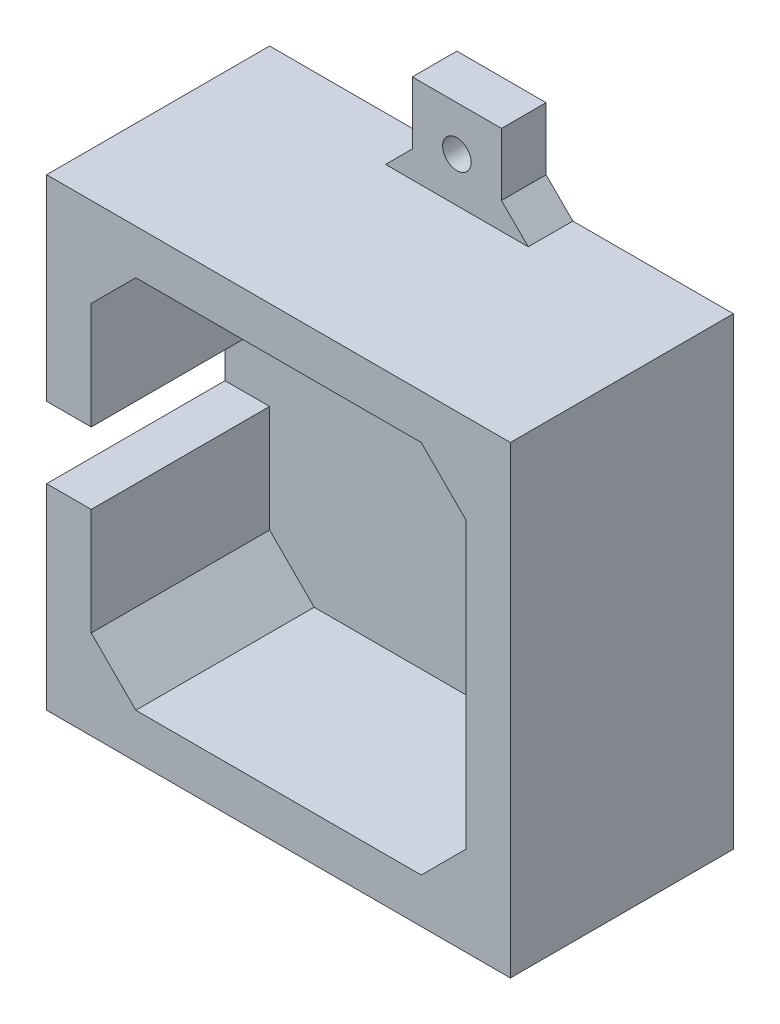
ISO-10303-21;
HEADER;
FILE_DESCRIPTION(('STEP AP214'),'2;1');
FILE_NAME('part.step','',(''),(''),'','','');
FILE_SCHEMA(('AUTOMOTIVE_DESIGN { 1 0 10303 214 1 1 1 1 }'));
ENDSEC;
DATA;
#1=APPLICATION_CONTEXT('core data for automotive mechanical design processes');
#2=APPLICATION_PROTOCOL_DEFINITION('international standard','automotive_design',2000,#1);
#3=PRODUCT_CONTEXT('',#1,'mechanical');
#4=PRODUCT('Part','Part','',(#3));
#5=PRODUCT_RELATED_PRODUCT_CATEGORY('part','',(#4));
#6=PRODUCT_DEFINITION_FORMATION('','',#4);
#7=PRODUCT_DEFINITION_CONTEXT('part definition',#1,'design');
#8=PRODUCT_DEFINITION('design','',#6,#7);
#9=PRODUCT_DEFINITION_SHAPE('','',#8);
#10=(LENGTH_UNIT() NAMED_UNIT(*) SI_UNIT(.MILLI.,.METRE.));
#11=(NAMED_UNIT(*) PLANE_ANGLE_UNIT() SI_UNIT($,.RADIAN.));
#12=(NAMED_UNIT(*) SI_UNIT($,.STERADIAN.) SOLID_ANGLE_UNIT());
#13=UNCERTAINTY_MEASURE_WITH_UNIT(LENGTH_MEASURE(1.E-05),#10,'distance_accuracy_value','');
#14=(GEOMETRIC_REPRESENTATION_CONTEXT(3) GLOBAL_UNCERTAINTY_ASSIGNED_CONTEXT((#13)) GLOBAL_UNIT_ASSIGNED_CONTEXT((#10,
#11,#12)) REPRESENTATION_CONTEXT('',''));
#15=CARTESIAN_POINT('',(0.,0.,0.));
#16=DIRECTION('',(0.,0.,1.));
#17=DIRECTION('',(1.,0.,0.));
#18=AXIS2_PLACEMENT_3D('',#15,#16,#17);
#19=CARTESIAN_POINT('',(0.,6.17050908734632,20.));
#20=DIRECTION('',(1.,0.,0.));
#21=DIRECTION('',(0.,1.,0.));
#22=AXIS2_PLACEMENT_3D('',#19,#20,#21);
#23=PLANE('',#22);
#24=DIRECTION('',(0.,-1.,0.));
#25=VECTOR('',#24,1.);
#26=CARTESIAN_POINT('',(0.,6.17050908734632,20.));
#27=LINE('',#26,#25);
#28=CARTESIAN_POINT('',(0.,38.1705090873463,20.));
#29=VERTEX_POINT('',#28);
#30=CARTESIAN_POINT('',(0.,26.1705090873463,20.));
#31=VERTEX_POINT('',#30);
#32=EDGE_CURVE('E350',#29,#31,#27,.T.);
#33=ORIENTED_EDGE('',*,*,#32,.T.);
#34=DIRECTION('',(0.,0.,-1.));
#35=VECTOR('',#34,1.);
#36=CARTESIAN_POINT('',(0.,26.1705090873463,20.));
#37=LINE('',#36,#35);
#38=CARTESIAN_POINT('',(0.,26.1705090873463,0.));
#39=VERTEX_POINT('',#38);
#40=EDGE_CURVE('E421',#31,#39,#37,.T.);
#41=ORIENTED_EDGE('',*,*,#40,.T.);
#42=DIRECTION('',(0.,-1.,0.));
#43=VECTOR('',#42,1.);
#44=CARTESIAN_POINT('',(0.,6.17050908734632,0.));
#45=LINE('',#44,#43);
#46=CARTESIAN_POINT('',(0.,38.1705090873463,0.));
#47=VERTEX_POINT('',#46);
#48=EDGE_CURVE('E372',#47,#39,#45,.T.);
#49=ORIENTED_EDGE('',*,*,#48,.F.);
#50=DIRECTION('',(0.,0.,-1.));
#51=VECTOR('',#50,1.);
#52=CARTESIAN_POINT('',(0.,38.1705090873463,20.));
#53=LINE('',#52,#51);
#54=EDGE_CURVE('E396',#29,#47,#53,.T.);
#55=ORIENTED_EDGE('',*,*,#54,.F.);
#56=EDGE_LOOP('',(#33,#41,#49,#55));
#57=FACE_BOUND('',#56,.T.);
#58=ADVANCED_FACE('F33',(#57),#23,.T.);
#59=CARTESIAN_POINT('',(-5.,48.1705090873463,20.));
#60=DIRECTION('',(0.,-1.,0.));
#61=DIRECTION('',(1.,0.,0.));
#62=AXIS2_PLACEMENT_3D('',#59,#60,#61);
#63=PLANE('',#62);
#64=DIRECTION('',(1.,0.,0.));
#65=VECTOR('',#64,1.);
#66=CARTESIAN_POINT('',(-5.00000000000001,48.1705090873463,-5.));
#67=LINE('',#66,#65);
#68=CARTESIAN_POINT('',(28.9999999999999,48.1705090873463,-5.));
#69=VERTEX_POINT('',#68);
#70=CARTESIAN_POINT('',(47.,48.1705090873463,-5.));
#71=VERTEX_POINT('',#70);
#72=EDGE_CURVE('E324',#69,#71,#67,.T.);
#73=ORIENTED_EDGE('',*,*,#72,.F.);
#74=DIRECTION('',(0.,0.,1.));
#75=VECTOR('',#74,1.);
#76=CARTESIAN_POINT('',(28.9999999999999,48.1705090873463,20.));
#77=LINE('',#76,#75);
#78=CARTESIAN_POINT('',(29.,48.1705090873463,0.));
#79=VERTEX_POINT('',#78);
#80=EDGE_CURVE('E284',#69,#79,#77,.T.);
#81=ORIENTED_EDGE('',*,*,#80,.T.);
#82=DIRECTION('',(-1.,0.,0.));
#83=VECTOR('',#82,1.);
#84=CARTESIAN_POINT('',(16.,48.1705090873463,0.));
#85=LINE('',#84,#83);
#86=CARTESIAN_POINT('',(13.,48.1705090873463,0.));
#87=VERTEX_POINT('',#86);
#88=EDGE_CURVE('E307',#79,#87,#85,.T.);
#89=ORIENTED_EDGE('',*,*,#88,.T.);
#90=DIRECTION('',(0.,0.,-1.));
#91=VECTOR('',#90,1.);
#92=CARTESIAN_POINT('',(13.,48.1705090873463,20.));
#93=LINE('',#92,#91);
#94=CARTESIAN_POINT('',(12.9999999999999,48.1705090873463,-5.));
#95=VERTEX_POINT('',#94);
#96=EDGE_CURVE('E281',#87,#95,#93,.T.);
#97=ORIENTED_EDGE('',*,*,#96,.T.);
#98=CARTESIAN_POINT('',(-5.00000000000001,48.1705090873463,-5.));
#99=VERTEX_POINT('',#98);
#100=EDGE_CURVE('E332',#99,#95,#67,.T.);
#101=ORIENTED_EDGE('',*,*,#100,.F.);
#102=DIRECTION('',(0.,0.,-1.));
#103=VECTOR('',#102,1.);
#104=CARTESIAN_POINT('',(-5.,48.1705090873463,20.));
#105=LINE('',#104,#103);
#106=CARTESIAN_POINT('',(-5.,48.1705090873463,20.));
#107=VERTEX_POINT('',#106);
#108=EDGE_CURVE('E258',#107,#99,#105,.T.);
#109=ORIENTED_EDGE('',*,*,#108,.F.);
#110=DIRECTION('',(-1.,0.,0.));
#111=VECTOR('',#110,1.);
#112=CARTESIAN_POINT('',(-5.,48.1705090873463,20.));
#113=LINE('',#112,#111);
#114=CARTESIAN_POINT('',(47.,48.1705090873463,20.));
#115=VERTEX_POINT('',#114);
#116=EDGE_CURVE('E256',#115,#107,#113,.T.);
#117=ORIENTED_EDGE('',*,*,#116,.F.);
#118=DIRECTION('',(0.,0.,-1.));
#119=VECTOR('',#118,1.);
#120=CARTESIAN_POINT('',(47.,48.1705090873463,20.));
#121=LINE('',#120,#119);
#122=EDGE_CURVE('E260',#115,#71,#121,.T.);
#123=ORIENTED_EDGE('',*,*,#122,.T.);
#124=EDGE_LOOP('',(#73,#81,#89,#97,#101,#109,#117,#123));
#125=FACE_BOUND('',#124,.T.);
#126=ADVANCED_FACE('F328',(#125),#63,.F.);
#127=CARTESIAN_POINT('',(47.,-3.82949091265368,20.));
#128=DIRECTION('',(0.,1.,0.));
#129=DIRECTION('',(0.,0.,1.));
#130=AXIS2_PLACEMENT_3D('',#127,#128,#129);
#131=PLANE('',#130);
#132=DIRECTION('',(1.,0.,0.));
#133=VECTOR('',#132,1.);
#134=CARTESIAN_POINT('',(-5.,-3.82949091265367,-5.));
#135=LINE('',#134,#133);
#136=CARTESIAN_POINT('',(-5.,-3.82949091265367,-5.));
#137=VERTEX_POINT('',#136);
#138=CARTESIAN_POINT('',(13.,-3.82949091265366,-5.));
#139=VERTEX_POINT('',#138);
#140=EDGE_CURVE('E333',#137,#139,#135,.T.);
#141=ORIENTED_EDGE('',*,*,#140,.T.);
#142=DIRECTION('',(0.,0.,1.));
#143=VECTOR('',#142,1.);
#144=CARTESIAN_POINT('',(13.,-3.82949091265368,20.));
#145=LINE('',#144,#143);
#146=CARTESIAN_POINT('',(13.,-3.82949091265366,0.));
#147=VERTEX_POINT('',#146);
#148=EDGE_CURVE('E273',#139,#147,#145,.T.);
#149=ORIENTED_EDGE('',*,*,#148,.T.);
#150=DIRECTION('',(1.,0.,0.));
#151=VECTOR('',#150,1.);
#152=CARTESIAN_POINT('',(16.,-3.82949091265366,0.));
#153=LINE('',#152,#151);
#154=CARTESIAN_POINT('',(29.,-3.82949091265366,0.));
#155=VERTEX_POINT('',#154);
#156=EDGE_CURVE('E451',#147,#155,#153,.T.);
#157=ORIENTED_EDGE('',*,*,#156,.T.);
#158=DIRECTION('',(0.,0.,-1.));
#159=VECTOR('',#158,1.);
#160=CARTESIAN_POINT('',(29.,-3.82949091265368,20.));
#161=LINE('',#160,#159);
#162=CARTESIAN_POINT('',(28.9999999999999,-3.82949091265366,-5.));
#163=VERTEX_POINT('',#162);
#164=EDGE_CURVE('E270',#155,#163,#161,.T.);
#165=ORIENTED_EDGE('',*,*,#164,.T.);
#166=CARTESIAN_POINT('',(47.,-3.82949091265365,-5.));
#167=VERTEX_POINT('',#166);
#168=EDGE_CURVE('E337',#163,#167,#135,.T.);
#169=ORIENTED_EDGE('',*,*,#168,.T.);
#170=DIRECTION('',(0.,0.,-1.));
#171=VECTOR('',#170,1.);
#172=CARTESIAN_POINT('',(47.,-3.82949091265368,20.));
#173=LINE('',#172,#171);
#174=CARTESIAN_POINT('',(47.,-3.82949091265368,20.));
#175=VERTEX_POINT('',#174);
#176=EDGE_CURVE('E263',#175,#167,#173,.T.);
#177=ORIENTED_EDGE('',*,*,#176,.F.);
#178=DIRECTION('',(1.,0.,0.));
#179=VECTOR('',#178,1.);
#180=CARTESIAN_POINT('',(47.,-3.82949091265368,20.));
#181=LINE('',#180,#179);
#182=CARTESIAN_POINT('',(-4.99999999999999,-3.82949091265368,20.));
#183=VERTEX_POINT('',#182);
#184=EDGE_CURVE('E247',#183,#175,#181,.T.);
#185=ORIENTED_EDGE('',*,*,#184,.F.);
#186=DIRECTION('',(0.,0.,-1.));
#187=VECTOR('',#186,1.);
#188=CARTESIAN_POINT('',(-4.99999999999999,-3.82949091265368,20.));
#189=LINE('',#188,#187);
#190=EDGE_CURVE('E243',#183,#137,#189,.T.);
#191=ORIENTED_EDGE('',*,*,#190,.T.);
#192=EDGE_LOOP('',(#141,#149,#157,#165,#169,#177,#185,#191));
#193=FACE_BOUND('',#192,.T.);
#194=ADVANCED_FACE('F449',(#193),#131,.F.);
#195=CARTESIAN_POINT('',(-5.,48.1705090873463,20.));
#196=DIRECTION('',(1.,0.,0.));
#197=DIRECTION('',(0.,1.,0.));
#198=AXIS2_PLACEMENT_3D('',#195,#196,#197);
#199=PLANE('',#198);
#200=DIRECTION('',(0.,0.,1.));
#201=VECTOR('',#200,1.);
#202=CARTESIAN_POINT('',(-5.,26.1705090873463,0.));
#203=LINE('',#202,#201);
#204=CARTESIAN_POINT('',(-5.,26.1705090873463,0.));
#205=VERTEX_POINT('',#204);
#206=CARTESIAN_POINT('',(-5.,26.1705090873463,20.));
#207=VERTEX_POINT('',#206);
#208=EDGE_CURVE('E228',#205,#207,#203,.T.);
#209=ORIENTED_EDGE('',*,*,#208,.T.);
#210=DIRECTION('',(0.,-1.,0.));
#211=VECTOR('',#210,1.);
#212=CARTESIAN_POINT('',(-5.,48.1705090873463,20.));
#213=LINE('',#212,#211);
#214=EDGE_CURVE('E244',#107,#207,#213,.T.);
#215=ORIENTED_EDGE('',*,*,#214,.F.);
#216=ORIENTED_EDGE('',*,*,#108,.T.);
#217=DIRECTION('',(0.,1.,0.));
#218=VECTOR('',#217,1.);
#219=CARTESIAN_POINT('',(-5.00000000000001,48.1705090873463,-5.));
#220=LINE('',#219,#218);
#221=EDGE_CURVE('E439',#137,#99,#220,.T.);
#222=ORIENTED_EDGE('',*,*,#221,.F.);
#223=ORIENTED_EDGE('',*,*,#190,.F.);
#224=CARTESIAN_POINT('',(-5.,18.1705090873463,20.));
#225=VERTEX_POINT('',#224);
#226=EDGE_CURVE('E234',#225,#183,#213,.T.);
#227=ORIENTED_EDGE('',*,*,#226,.F.);
#228=DIRECTION('',(0.,0.,-1.));
#229=VECTOR('',#228,1.);
#230=CARTESIAN_POINT('',(-5.,18.1705090873463,0.));
#231=LINE('',#230,#229);
#232=CARTESIAN_POINT('',(-5.,18.1705090873463,0.));
#233=VERTEX_POINT('',#232);
#234=EDGE_CURVE('E218',#225,#233,#231,.T.);
#235=ORIENTED_EDGE('',*,*,#234,.T.);
#236=DIRECTION('',(0.,1.,0.));
#237=VECTOR('',#236,1.);
#238=CARTESIAN_POINT('',(-4.99999999999999,0.,0.));
#239=LINE('',#238,#237);
#240=EDGE_CURVE('E229',#233,#205,#239,.T.);
#241=ORIENTED_EDGE('',*,*,#240,.T.);
#242=EDGE_LOOP('',(#209,#215,#216,#222,#223,#227,#235,#241));
#243=FACE_BOUND('',#242,.T.);
#244=ADVANCED_FACE('F241',(#243),#199,.F.);
#245=DIRECTION('',(0.,0.,1.));
#246=VECTOR('',#245,1.);
#247=CARTESIAN_POINT('',(0.,18.1705090873463,20.));
#248=LINE('',#247,#246);
#249=CARTESIAN_POINT('',(0.,18.1705090873463,0.));
#250=VERTEX_POINT('',#249);
#251=CARTESIAN_POINT('',(0.,18.1705090873463,20.));
#252=VERTEX_POINT('',#251);
#253=EDGE_CURVE('E425',#250,#252,#248,.T.);
#254=ORIENTED_EDGE('',*,*,#253,.T.);
#255=CARTESIAN_POINT('',(0.,6.17050908734632,20.));
#256=VERTEX_POINT('',#255);
#257=EDGE_CURVE('E237',#252,#256,#27,.T.);
#258=ORIENTED_EDGE('',*,*,#257,.T.);
#259=DIRECTION('',(0.,0.,-1.));
#260=VECTOR('',#259,1.);
#261=CARTESIAN_POINT('',(0.,6.17050908734632,20.));
#262=LINE('',#261,#260);
#263=CARTESIAN_POINT('',(0.,6.17050908734632,0.));
#264=VERTEX_POINT('',#263);
#265=EDGE_CURVE('E393',#256,#264,#262,.T.);
#266=ORIENTED_EDGE('',*,*,#265,.T.);
#267=EDGE_CURVE('E371',#250,#264,#45,.T.);
#268=ORIENTED_EDGE('',*,*,#267,.F.);
#269=EDGE_LOOP('',(#254,#258,#266,#268));
#270=FACE_BOUND('',#269,.T.);
#271=ADVANCED_FACE('F547',(#270),#23,.T.);
#272=CARTESIAN_POINT('',(0.,0.,20.));
#273=DIRECTION('',(0.,0.,-1.));
#274=DIRECTION('',(-1.,0.,0.));
#275=AXIS2_PLACEMENT_3D('',#272,#273,#274);
#276=PLANE('',#275);
#277=ORIENTED_EDGE('',*,*,#214,.T.);
#278=DIRECTION('',(1.,0.,0.));
#279=VECTOR('',#278,1.);
#280=CARTESIAN_POINT('',(0.,26.1705090873463,20.));
#281=LINE('',#280,#279);
#282=EDGE_CURVE('E238',#207,#31,#281,.T.);
#283=ORIENTED_EDGE('',*,*,#282,.T.);
#284=ORIENTED_EDGE('',*,*,#32,.F.);
#285=DIRECTION('',(-0.707106781186548,-0.707106781186547,0.));
#286=VECTOR('',#285,1.);
#287=CARTESIAN_POINT('',(0.,38.1705090873463,20.));
#288=LINE('',#287,#286);
#289=CARTESIAN_POINT('',(4.99999999999999,43.1705090873463,20.));
#290=VERTEX_POINT('',#289);
#291=EDGE_CURVE('E348',#290,#29,#288,.T.);
#292=ORIENTED_EDGE('',*,*,#291,.F.);
#293=DIRECTION('',(-1.,0.,0.));
#294=VECTOR('',#293,1.);
#295=CARTESIAN_POINT('',(4.99999999999999,43.1705090873463,20.));
#296=LINE('',#295,#294);
#297=CARTESIAN_POINT('',(37.,43.1705090873463,20.));
#298=VERTEX_POINT('',#297);
#299=EDGE_CURVE('E345',#298,#290,#296,.T.);
#300=ORIENTED_EDGE('',*,*,#299,.F.);
#301=DIRECTION('',(-0.707106781186547,0.707106781186547,0.));
#302=VECTOR('',#301,1.);
#303=CARTESIAN_POINT('',(37.,43.1705090873463,20.));
#304=LINE('',#303,#302);
#305=CARTESIAN_POINT('',(42.,38.1705090873463,20.));
#306=VERTEX_POINT('',#305);
#307=EDGE_CURVE('E343',#306,#298,#304,.T.);
#308=ORIENTED_EDGE('',*,*,#307,.F.);
#309=DIRECTION('',(0.,1.,0.));
#310=VECTOR('',#309,1.);
#311=CARTESIAN_POINT('',(42.,6.17050908734633,20.));
#312=LINE('',#311,#310);
#313=CARTESIAN_POINT('',(42.,6.17050908734633,20.));
#314=VERTEX_POINT('',#313);
#315=EDGE_CURVE('E360',#314,#306,#312,.T.);
#316=ORIENTED_EDGE('',*,*,#315,.F.);
#317=DIRECTION('',(0.707106781186547,0.707106781186548,0.));
#318=VECTOR('',#317,1.);
#319=CARTESIAN_POINT('',(37.,1.17050908734632,20.));
#320=LINE('',#319,#318);
#321=CARTESIAN_POINT('',(37.,1.17050908734632,20.));
#322=VERTEX_POINT('',#321);
#323=EDGE_CURVE('E357',#322,#314,#320,.T.);
#324=ORIENTED_EDGE('',*,*,#323,.F.);
#325=DIRECTION('',(1.,0.,0.));
#326=VECTOR('',#325,1.);
#327=CARTESIAN_POINT('',(5.,1.17050908734632,20.));
#328=LINE('',#327,#326);
#329=CARTESIAN_POINT('',(5.,1.17050908734632,20.));
#330=VERTEX_POINT('',#329);
#331=EDGE_CURVE('E355',#330,#322,#328,.T.);
#332=ORIENTED_EDGE('',*,*,#331,.F.);
#333=DIRECTION('',(0.707106781186548,-0.707106781186547,0.));
#334=VECTOR('',#333,1.);
#335=CARTESIAN_POINT('',(0.,6.17050908734632,20.));
#336=LINE('',#335,#334);
#337=EDGE_CURVE('E353',#256,#330,#336,.T.);
#338=ORIENTED_EDGE('',*,*,#337,.F.);
#339=ORIENTED_EDGE('',*,*,#257,.F.);
#340=DIRECTION('',(-1.,0.,0.));
#341=VECTOR('',#340,1.);
#342=CARTESIAN_POINT('',(0.,18.1705090873463,20.));
#343=LINE('',#342,#341);
#344=EDGE_CURVE('E221',#252,#225,#343,.T.);
#345=ORIENTED_EDGE('',*,*,#344,.T.);
#346=ORIENTED_EDGE('',*,*,#226,.T.);
#347=ORIENTED_EDGE('',*,*,#184,.T.);
#348=DIRECTION('',(0.,1.,0.));
#349=VECTOR('',#348,1.);
#350=CARTESIAN_POINT('',(47.,48.1705090873463,20.));
#351=LINE('',#350,#349);
#352=EDGE_CURVE('E254',#175,#115,#351,.T.);
#353=ORIENTED_EDGE('',*,*,#352,.T.);
#354=ORIENTED_EDGE('',*,*,#116,.T.);
#355=EDGE_LOOP('',(#277,#283,#284,#292,#300,#308,#316,#324,#332,#338,#339,#345,#346,#347,#353,#354));
#356=FACE_BOUND('',#355,.T.);
#357=ADVANCED_FACE('F233',(#356),#276,.F.);
#358=CARTESIAN_POINT('',(47.,48.1705090873463,20.));
#359=DIRECTION('',(-1.,0.,0.));
#360=DIRECTION('',(0.,-1.,0.));
#361=AXIS2_PLACEMENT_3D('',#358,#359,#360);
#362=PLANE('',#361);
#363=ORIENTED_EDGE('',*,*,#176,.T.);
#364=DIRECTION('',(0.,1.,0.));
#365=VECTOR('',#364,1.);
#366=CARTESIAN_POINT('',(47.,48.1705090873463,-5.));
#367=LINE('',#366,#365);
#368=EDGE_CURVE('E340',#167,#71,#367,.T.);
#369=ORIENTED_EDGE('',*,*,#368,.T.);
#370=ORIENTED_EDGE('',*,*,#122,.F.);
#371=ORIENTED_EDGE('',*,*,#352,.F.);
#372=EDGE_LOOP('',(#363,#369,#370,#371));
#373=FACE_BOUND('',#372,.T.);
#374=ADVANCED_FACE('F443',(#373),#362,.F.);
#375=CARTESIAN_POINT('',(37.,43.1705090873463,20.));
#376=DIRECTION('',(-0.707106781186548,-0.707106781186548,0.));
#377=DIRECTION('',(0.707106781186548,-0.707106781186548,0.));
#378=AXIS2_PLACEMENT_3D('',#375,#376,#377);
#379=PLANE('',#378);
#380=DIRECTION('',(-0.707106781186547,0.707106781186547,0.));
#381=VECTOR('',#380,1.);
#382=CARTESIAN_POINT('',(37.,43.1705090873463,0.));
#383=LINE('',#382,#381);
#384=CARTESIAN_POINT('',(42.,38.1705090873463,0.));
#385=VERTEX_POINT('',#384);
#386=CARTESIAN_POINT('',(37.,43.1705090873463,0.));
#387=VERTEX_POINT('',#386);
#388=EDGE_CURVE('E335',#385,#387,#383,.T.);
#389=ORIENTED_EDGE('',*,*,#388,.F.);
#390=DIRECTION('',(0.,0.,-1.));
#391=VECTOR('',#390,1.);
#392=CARTESIAN_POINT('',(42.,38.1705090873463,20.));
#393=LINE('',#392,#391);
#394=EDGE_CURVE('E362',#306,#385,#393,.T.);
#395=ORIENTED_EDGE('',*,*,#394,.F.);
#396=ORIENTED_EDGE('',*,*,#307,.T.);
#397=DIRECTION('',(0.,0.,-1.));
#398=VECTOR('',#397,1.);
#399=CARTESIAN_POINT('',(37.,43.1705090873463,20.));
#400=LINE('',#399,#398);
#401=EDGE_CURVE('E245',#298,#387,#400,.T.);
#402=ORIENTED_EDGE('',*,*,#401,.T.);
#403=EDGE_LOOP('',(#389,#395,#396,#402));
#404=FACE_BOUND('',#403,.T.);
#405=ADVANCED_FACE('F414',(#404),#379,.T.);
#406=CARTESIAN_POINT('',(4.99999999999999,43.1705090873463,20.));
#407=DIRECTION('',(0.,-1.,0.));
#408=DIRECTION('',(0.,0.,-1.));
#409=AXIS2_PLACEMENT_3D('',#406,#407,#408);
#410=PLANE('',#409);
#411=DIRECTION('',(-1.,0.,0.));
#412=VECTOR('',#411,1.);
#413=CARTESIAN_POINT('',(4.99999999999999,43.1705090873463,0.));
#414=LINE('',#413,#412);
#415=CARTESIAN_POINT('',(4.99999999999999,43.1705090873463,0.));
#416=VERTEX_POINT('',#415);
#417=EDGE_CURVE('E365',#387,#416,#414,.T.);
#418=ORIENTED_EDGE('',*,*,#417,.F.);
#419=ORIENTED_EDGE('',*,*,#401,.F.);
#420=ORIENTED_EDGE('',*,*,#299,.T.);
#421=DIRECTION('',(0.,0.,-1.));
#422=VECTOR('',#421,1.);
#423=CARTESIAN_POINT('',(4.99999999999999,43.1705090873463,20.));
#424=LINE('',#423,#422);
#425=EDGE_CURVE('E249',#290,#416,#424,.T.);
#426=ORIENTED_EDGE('',*,*,#425,.T.);
#427=EDGE_LOOP('',(#418,#419,#420,#426));
#428=FACE_BOUND('',#427,.T.);
#429=ADVANCED_FACE('F400',(#428),#410,.T.);
#430=CARTESIAN_POINT('',(0.,38.1705090873463,20.));
#431=DIRECTION('',(0.707106781186547,-0.707106781186548,0.));
#432=DIRECTION('',(0.707106781186548,0.707106781186547,0.));
#433=AXIS2_PLACEMENT_3D('',#430,#431,#432);
#434=PLANE('',#433);
#435=DIRECTION('',(-0.707106781186548,-0.707106781186547,0.));
#436=VECTOR('',#435,1.);
#437=CARTESIAN_POINT('',(0.,38.1705090873463,0.));
#438=LINE('',#437,#436);
#439=EDGE_CURVE('E368',#416,#47,#438,.T.);
#440=ORIENTED_EDGE('',*,*,#439,.F.);
#441=ORIENTED_EDGE('',*,*,#425,.F.);
#442=ORIENTED_EDGE('',*,*,#291,.T.);
#443=ORIENTED_EDGE('',*,*,#54,.T.);
#444=EDGE_LOOP('',(#440,#441,#442,#443));
#445=FACE_BOUND('',#444,.T.);
#446=ADVANCED_FACE('F405',(#445),#434,.T.);
#447=CARTESIAN_POINT('',(0.,6.17050908734632,20.));
#448=DIRECTION('',(0.707106781186547,0.707106781186548,0.));
#449=DIRECTION('',(-0.707106781186548,0.707106781186547,0.));
#450=AXIS2_PLACEMENT_3D('',#447,#448,#449);
#451=PLANE('',#450);
#452=DIRECTION('',(0.707106781186548,-0.707106781186547,0.));
#453=VECTOR('',#452,1.);
#454=CARTESIAN_POINT('',(0.,6.17050908734632,0.));
#455=LINE('',#454,#453);
#456=CARTESIAN_POINT('',(5.,1.17050908734632,0.));
#457=VERTEX_POINT('',#456);
#458=EDGE_CURVE('E375',#264,#457,#455,.T.);
#459=ORIENTED_EDGE('',*,*,#458,.F.);
#460=ORIENTED_EDGE('',*,*,#265,.F.);
#461=ORIENTED_EDGE('',*,*,#337,.T.);
#462=DIRECTION('',(0.,0.,-1.));
#463=VECTOR('',#462,1.);
#464=CARTESIAN_POINT('',(5.,1.17050908734632,20.));
#465=LINE('',#464,#463);
#466=EDGE_CURVE('E391',#330,#457,#465,.T.);
#467=ORIENTED_EDGE('',*,*,#466,.T.);
#468=EDGE_LOOP('',(#459,#460,#461,#467));
#469=FACE_BOUND('',#468,.T.);
#470=ADVANCED_FACE('F567',(#469),#451,.T.);
#471=CARTESIAN_POINT('',(5.,1.17050908734632,20.));
#472=DIRECTION('',(0.,1.,0.));
#473=DIRECTION('',(-1.,0.,0.));
#474=AXIS2_PLACEMENT_3D('',#471,#472,#473);
#475=PLANE('',#474);
#476=DIRECTION('',(1.,0.,0.));
#477=VECTOR('',#476,1.);
#478=CARTESIAN_POINT('',(5.,1.17050908734632,0.));
#479=LINE('',#478,#477);
#480=CARTESIAN_POINT('',(37.,1.17050908734632,0.));
#481=VERTEX_POINT('',#480);
#482=EDGE_CURVE('E378',#457,#481,#479,.T.);
#483=ORIENTED_EDGE('',*,*,#482,.F.);
#484=ORIENTED_EDGE('',*,*,#466,.F.);
#485=ORIENTED_EDGE('',*,*,#331,.T.);
#486=DIRECTION('',(0.,0.,-1.));
#487=VECTOR('',#486,1.);
#488=CARTESIAN_POINT('',(37.,1.17050908734632,20.));
#489=LINE('',#488,#487);
#490=EDGE_CURVE('E389',#322,#481,#489,.T.);
#491=ORIENTED_EDGE('',*,*,#490,.T.);
#492=EDGE_LOOP('',(#483,#484,#485,#491));
#493=FACE_BOUND('',#492,.T.);
#494=ADVANCED_FACE('F572',(#493),#475,.T.);
#495=CARTESIAN_POINT('',(37.,1.17050908734632,20.));
#496=DIRECTION('',(-0.707106781186548,0.707106781186547,0.));
#497=DIRECTION('',(-0.707106781186547,-0.707106781186548,0.));
#498=AXIS2_PLACEMENT_3D('',#495,#496,#497);
#499=PLANE('',#498);
#500=DIRECTION('',(0.707106781186547,0.707106781186548,0.));
#501=VECTOR('',#500,1.);
#502=CARTESIAN_POINT('',(37.,1.17050908734632,0.));
#503=LINE('',#502,#501);
#504=CARTESIAN_POINT('',(42.,6.17050908734633,0.));
#505=VERTEX_POINT('',#504);
#506=EDGE_CURVE('E381',#481,#505,#503,.T.);
#507=ORIENTED_EDGE('',*,*,#506,.F.);
#508=ORIENTED_EDGE('',*,*,#490,.F.);
#509=ORIENTED_EDGE('',*,*,#323,.T.);
#510=DIRECTION('',(0.,0.,-1.));
#511=VECTOR('',#510,1.);
#512=CARTESIAN_POINT('',(42.,6.17050908734633,20.));
#513=LINE('',#512,#511);
#514=EDGE_CURVE('E387',#314,#505,#513,.T.);
#515=ORIENTED_EDGE('',*,*,#514,.T.);
#516=EDGE_LOOP('',(#507,#508,#509,#515));
#517=FACE_BOUND('',#516,.T.);
#518=ADVANCED_FACE('F576',(#517),#499,.T.);
#519=CARTESIAN_POINT('',(42.,6.17050908734633,20.));
#520=DIRECTION('',(-1.,0.,0.));
#521=DIRECTION('',(0.,-1.,0.));
#522=AXIS2_PLACEMENT_3D('',#519,#520,#521);
#523=PLANE('',#522);
#524=DIRECTION('',(0.,1.,0.));
#525=VECTOR('',#524,1.);
#526=CARTESIAN_POINT('',(42.,6.17050908734633,0.));
#527=LINE('',#526,#525);
#528=EDGE_CURVE('E346',#505,#385,#527,.T.);
#529=ORIENTED_EDGE('',*,*,#528,.F.);
#530=ORIENTED_EDGE('',*,*,#514,.F.);
#531=ORIENTED_EDGE('',*,*,#315,.T.);
#532=ORIENTED_EDGE('',*,*,#394,.T.);
#533=EDGE_LOOP('',(#529,#530,#531,#532));
#534=FACE_BOUND('',#533,.T.);
#535=ADVANCED_FACE('F579',(#534),#523,.T.);
#536=CARTESIAN_POINT('',(-5.00000000000001,48.1705090873463,0.));
#537=DIRECTION('',(0.,0.,1.));
#538=DIRECTION('',(1.,0.,0.));
#539=AXIS2_PLACEMENT_3D('',#536,#537,#538);
#540=PLANE('',#539);
#541=ORIENTED_EDGE('',*,*,#48,.T.);
#542=DIRECTION('',(-1.,0.,0.));
#543=VECTOR('',#542,1.);
#544=CARTESIAN_POINT('',(28.,26.1705090873463,0.));
#545=LINE('',#544,#543);
#546=EDGE_CURVE('E422',#39,#205,#545,.T.);
#547=ORIENTED_EDGE('',*,*,#546,.T.);
#548=ORIENTED_EDGE('',*,*,#240,.F.);
#549=DIRECTION('',(-1.,0.,0.));
#550=VECTOR('',#549,1.);
#551=CARTESIAN_POINT('',(28.,18.1705090873463,0.));
#552=LINE('',#551,#550);
#553=EDGE_CURVE('E224',#250,#233,#552,.T.);
#554=ORIENTED_EDGE('',*,*,#553,.F.);
#555=ORIENTED_EDGE('',*,*,#267,.T.);
#556=ORIENTED_EDGE('',*,*,#458,.T.);
#557=ORIENTED_EDGE('',*,*,#482,.T.);
#558=ORIENTED_EDGE('',*,*,#506,.T.);
#559=ORIENTED_EDGE('',*,*,#528,.T.);
#560=ORIENTED_EDGE('',*,*,#388,.T.);
#561=ORIENTED_EDGE('',*,*,#417,.T.);
#562=ORIENTED_EDGE('',*,*,#439,.T.);
#563=EDGE_LOOP('',(#541,#547,#548,#554,#555,#556,#557,#558,#559,#560,#561,#562));
#564=FACE_BOUND('',#563,.T.);
#565=ADVANCED_FACE('F409',(#564),#540,.T.);
#566=CARTESIAN_POINT('',(-5.00000000000001,48.1705090873463,-5.));
#567=DIRECTION('',(0.,0.,-1.));
#568=DIRECTION('',(-1.,0.,0.));
#569=AXIS2_PLACEMENT_3D('',#566,#567,#568);
#570=PLANE('',#569);
#571=ORIENTED_EDGE('',*,*,#368,.F.);
#572=ORIENTED_EDGE('',*,*,#168,.F.);
#573=DIRECTION('',(-0.707106781186552,-0.707106781186543,0.));
#574=VECTOR('',#573,1.);
#575=CARTESIAN_POINT('',(29.,-3.82949091265368,-5.));
#576=LINE('',#575,#574);
#577=CARTESIAN_POINT('',(26.,-6.82949091265363,-5.));
#578=VERTEX_POINT('',#577);
#579=EDGE_CURVE('E292',#163,#578,#576,.T.);
#580=ORIENTED_EDGE('',*,*,#579,.T.);
#581=DIRECTION('',(0.,-1.,0.));
#582=VECTOR('',#581,1.);
#583=CARTESIAN_POINT('',(26.,-3.82949091265366,-5.));
#584=LINE('',#583,#582);
#585=CARTESIAN_POINT('',(26.,-13.8294909126537,-5.));
#586=VERTEX_POINT('',#585);
#587=EDGE_CURVE('E462',#578,#586,#584,.T.);
#588=ORIENTED_EDGE('',*,*,#587,.T.);
#589=DIRECTION('',(-1.,0.,0.));
#590=VECTOR('',#589,1.);
#591=CARTESIAN_POINT('',(26.,-13.8294909126537,-5.));
#592=LINE('',#591,#590);
#593=CARTESIAN_POINT('',(16.,-13.8294909126537,-5.));
#594=VERTEX_POINT('',#593);
#595=EDGE_CURVE('E479',#586,#594,#592,.T.);
#596=ORIENTED_EDGE('',*,*,#595,.T.);
#597=DIRECTION('',(0.,1.,0.));
#598=VECTOR('',#597,1.);
#599=CARTESIAN_POINT('',(16.,-13.8294909126537,-5.));
#600=LINE('',#599,#598);
#601=CARTESIAN_POINT('',(16.,-6.82949091265368,-5.));
#602=VERTEX_POINT('',#601);
#603=EDGE_CURVE('E472',#594,#602,#600,.T.);
#604=ORIENTED_EDGE('',*,*,#603,.T.);
#605=DIRECTION('',(-0.707106781186543,0.707106781186552,0.));
#606=VECTOR('',#605,1.);
#607=CARTESIAN_POINT('',(16.,-6.82949091265368,-5.));
#608=LINE('',#607,#606);
#609=EDGE_CURVE('E288',#602,#139,#608,.T.);
#610=ORIENTED_EDGE('',*,*,#609,.T.);
#611=ORIENTED_EDGE('',*,*,#140,.F.);
#612=ORIENTED_EDGE('',*,*,#221,.T.);
#613=ORIENTED_EDGE('',*,*,#100,.T.);
#614=DIRECTION('',(0.707106781186552,0.707106781186543,0.));
#615=VECTOR('',#614,1.);
#616=CARTESIAN_POINT('',(13.,48.1705090873463,-5.));
#617=LINE('',#616,#615);
#618=CARTESIAN_POINT('',(16.,51.1705090873463,-5.));
#619=VERTEX_POINT('',#618);
#620=EDGE_CURVE('E41',#95,#619,#617,.T.);
#621=ORIENTED_EDGE('',*,*,#620,.T.);
#622=DIRECTION('',(0.,1.,0.));
#623=VECTOR('',#622,1.);
#624=CARTESIAN_POINT('',(16.,58.1705090873463,-5.));
#625=LINE('',#624,#623);
#626=CARTESIAN_POINT('',(16.,58.1705090873463,-5.));
#627=VERTEX_POINT('',#626);
#628=EDGE_CURVE('E510',#619,#627,#625,.T.);
#629=ORIENTED_EDGE('',*,*,#628,.T.);
#630=DIRECTION('',(1.,0.,0.));
#631=VECTOR('',#630,1.);
#632=CARTESIAN_POINT('',(26.,58.1705090873463,-5.));
#633=LINE('',#632,#631);
#634=CARTESIAN_POINT('',(26.,58.1705090873463,-5.));
#635=VERTEX_POINT('',#634);
#636=EDGE_CURVE('E506',#627,#635,#633,.T.);
#637=ORIENTED_EDGE('',*,*,#636,.T.);
#638=DIRECTION('',(0.,-1.,0.));
#639=VECTOR('',#638,1.);
#640=CARTESIAN_POINT('',(26.,48.1705090873463,-5.));
#641=LINE('',#640,#639);
#642=CARTESIAN_POINT('',(26.,51.1705090873463,-5.));
#643=VERTEX_POINT('',#642);
#644=EDGE_CURVE('E326',#635,#643,#641,.T.);
#645=ORIENTED_EDGE('',*,*,#644,.T.);
#646=DIRECTION('',(0.707106781186545,-0.70710678118655,0.));
#647=VECTOR('',#646,1.);
#648=CARTESIAN_POINT('',(26.,51.1705090873463,-5.));
#649=LINE('',#648,#647);
#650=EDGE_CURVE('E297',#643,#69,#649,.T.);
#651=ORIENTED_EDGE('',*,*,#650,.T.);
#652=ORIENTED_EDGE('',*,*,#72,.T.);
#653=EDGE_LOOP('',(#571,#572,#580,#588,#596,#604,#610,#611,#612,#613,#621,#629,#637,#645,#651,#652));
#654=FACE_BOUND('',#653,.T.);
#655=CARTESIAN_POINT('',(21.,-8.82949091265366,-5.));
#656=DIRECTION('',(0.,0.,-1.));
#657=DIRECTION('',(-1.,0.,0.));
#658=AXIS2_PLACEMENT_3D('',#655,#656,#657);
#659=CIRCLE('',#658,1.6);
#660=CARTESIAN_POINT('',(19.4,-8.82949091265366,-5.));
#661=VERTEX_POINT('',#660);
#662=EDGE_CURVE('E512',#661,#661,#659,.T.);
#663=ORIENTED_EDGE('',*,*,#662,.F.);
#664=EDGE_LOOP('',(#663));
#665=FACE_BOUND('',#664,.T.);
#666=CARTESIAN_POINT('',(21.,53.1705090873463,-5.));
#667=DIRECTION('',(0.,0.,-1.));
#668=DIRECTION('',(-1.,0.,0.));
#669=AXIS2_PLACEMENT_3D('',#666,#667,#668);
#670=CIRCLE('',#669,1.6);
#671=CARTESIAN_POINT('',(19.4,53.1705090873463,-5.));
#672=VERTEX_POINT('',#671);
#673=EDGE_CURVE('E524',#672,#672,#670,.T.);
#674=ORIENTED_EDGE('',*,*,#673,.F.);
#675=EDGE_LOOP('',(#674));
#676=FACE_BOUND('',#675,.T.);
#677=ADVANCED_FACE('F322',(#654,#665,#676),#570,.T.);
#678=CARTESIAN_POINT('',(28.,26.1705090873463,0.));
#679=DIRECTION('',(0.,-1.,0.));
#680=DIRECTION('',(1.,0.,0.));
#681=AXIS2_PLACEMENT_3D('',#678,#679,#680);
#682=PLANE('',#681);
#683=ORIENTED_EDGE('',*,*,#40,.F.);
#684=ORIENTED_EDGE('',*,*,#282,.F.);
#685=ORIENTED_EDGE('',*,*,#208,.F.);
#686=ORIENTED_EDGE('',*,*,#546,.F.);
#687=EDGE_LOOP('',(#683,#684,#685,#686));
#688=FACE_BOUND('',#687,.T.);
#689=ADVANCED_FACE('F428',(#688),#682,.T.);
#690=CARTESIAN_POINT('',(28.,18.1705090873463,0.));
#691=DIRECTION('',(0.,1.,0.));
#692=DIRECTION('',(-1.,0.,0.));
#693=AXIS2_PLACEMENT_3D('',#690,#691,#692);
#694=PLANE('',#693);
#695=ORIENTED_EDGE('',*,*,#553,.T.);
#696=ORIENTED_EDGE('',*,*,#234,.F.);
#697=ORIENTED_EDGE('',*,*,#344,.F.);
#698=ORIENTED_EDGE('',*,*,#253,.F.);
#699=EDGE_LOOP('',(#695,#696,#697,#698));
#700=FACE_BOUND('',#699,.T.);
#701=ADVANCED_FACE('F220',(#700),#694,.T.);
#702=CARTESIAN_POINT('',(16.,-13.8294909126537,0.));
#703=DIRECTION('',(-1.,0.,0.));
#704=DIRECTION('',(0.,-1.,0.));
#705=AXIS2_PLACEMENT_3D('',#702,#703,#704);
#706=PLANE('',#705);
#707=DIRECTION('',(0.,1.,0.));
#708=VECTOR('',#707,1.);
#709=CARTESIAN_POINT('',(16.,-13.8294909126537,0.));
#710=LINE('',#709,#708);
#711=CARTESIAN_POINT('',(16.,-13.8294909126537,0.));
#712=VERTEX_POINT('',#711);
#713=CARTESIAN_POINT('',(16.,-6.82949091265368,0.));
#714=VERTEX_POINT('',#713);
#715=EDGE_CURVE('E470',#712,#714,#710,.T.);
#716=ORIENTED_EDGE('',*,*,#715,.T.);
#717=DIRECTION('',(0.,0.,-1.));
#718=VECTOR('',#717,1.);
#719=CARTESIAN_POINT('',(16.,-6.82949091265368,0.));
#720=LINE('',#719,#718);
#721=EDGE_CURVE('E267',#714,#602,#720,.T.);
#722=ORIENTED_EDGE('',*,*,#721,.T.);
#723=ORIENTED_EDGE('',*,*,#603,.F.);
#724=DIRECTION('',(0.,0.,-1.));
#725=VECTOR('',#724,1.);
#726=CARTESIAN_POINT('',(16.,-13.8294909126537,0.));
#727=LINE('',#726,#725);
#728=EDGE_CURVE('E431',#712,#594,#727,.T.);
#729=ORIENTED_EDGE('',*,*,#728,.F.);
#730=EDGE_LOOP('',(#716,#722,#723,#729));
#731=FACE_BOUND('',#730,.T.);
#732=ADVANCED_FACE('F487',(#731),#706,.T.);
#733=CARTESIAN_POINT('',(26.,-13.8294909126537,0.));
#734=DIRECTION('',(0.,-1.,0.));
#735=DIRECTION('',(0.,0.,-1.));
#736=AXIS2_PLACEMENT_3D('',#733,#734,#735);
#737=PLANE('',#736);
#738=ORIENTED_EDGE('',*,*,#595,.F.);
#739=DIRECTION('',(0.,0.,-1.));
#740=VECTOR('',#739,1.);
#741=CARTESIAN_POINT('',(26.,-13.8294909126537,0.));
#742=LINE('',#741,#740);
#743=CARTESIAN_POINT('',(26.,-13.8294909126537,0.));
#744=VERTEX_POINT('',#743);
#745=EDGE_CURVE('E433',#744,#586,#742,.T.);
#746=ORIENTED_EDGE('',*,*,#745,.F.);
#747=DIRECTION('',(-1.,0.,0.));
#748=VECTOR('',#747,1.);
#749=CARTESIAN_POINT('',(26.,-13.8294909126537,0.));
#750=LINE('',#749,#748);
#751=EDGE_CURVE('E468',#744,#712,#750,.T.);
#752=ORIENTED_EDGE('',*,*,#751,.T.);
#753=ORIENTED_EDGE('',*,*,#728,.T.);
#754=EDGE_LOOP('',(#738,#746,#752,#753));
#755=FACE_BOUND('',#754,.T.);
#756=ADVANCED_FACE('F659',(#755),#737,.T.);
#757=CARTESIAN_POINT('',(26.,-3.82949091265366,0.));
#758=DIRECTION('',(1.,0.,0.));
#759=DIRECTION('',(0.,1.,0.));
#760=AXIS2_PLACEMENT_3D('',#757,#758,#759);
#761=PLANE('',#760);
#762=ORIENTED_EDGE('',*,*,#587,.F.);
#763=DIRECTION('',(0.,0.,1.));
#764=VECTOR('',#763,1.);
#765=CARTESIAN_POINT('',(26.,-6.82949091265363,0.));
#766=LINE('',#765,#764);
#767=CARTESIAN_POINT('',(26.,-6.82949091265363,0.));
#768=VERTEX_POINT('',#767);
#769=EDGE_CURVE('E276',#578,#768,#766,.T.);
#770=ORIENTED_EDGE('',*,*,#769,.T.);
#771=DIRECTION('',(0.,-1.,0.));
#772=VECTOR('',#771,1.);
#773=CARTESIAN_POINT('',(26.,-3.82949091265366,0.));
#774=LINE('',#773,#772);
#775=EDGE_CURVE('E460',#768,#744,#774,.T.);
#776=ORIENTED_EDGE('',*,*,#775,.T.);
#777=ORIENTED_EDGE('',*,*,#745,.T.);
#778=EDGE_LOOP('',(#762,#770,#776,#777));
#779=FACE_BOUND('',#778,.T.);
#780=ADVANCED_FACE('F458',(#779),#761,.T.);
#781=CARTESIAN_POINT('',(0.,0.,0.));
#782=DIRECTION('',(0.,0.,-1.));
#783=DIRECTION('',(-1.,0.,0.));
#784=AXIS2_PLACEMENT_3D('',#781,#782,#783);
#785=PLANE('',#784);
#786=CARTESIAN_POINT('',(21.,-8.82949091265366,0.));
#787=DIRECTION('',(0.,0.,-1.));
#788=DIRECTION('',(-1.,0.,0.));
#789=AXIS2_PLACEMENT_3D('',#786,#787,#788);
#790=CIRCLE('',#789,1.6);
#791=CARTESIAN_POINT('',(19.4,-8.82949091265366,0.));
#792=VERTEX_POINT('',#791);
#793=EDGE_CURVE('E480',#792,#792,#790,.T.);
#794=ORIENTED_EDGE('',*,*,#793,.T.);
#795=EDGE_LOOP('',(#794));
#796=FACE_BOUND('',#795,.T.);
#797=ORIENTED_EDGE('',*,*,#156,.F.);
#798=DIRECTION('',(0.707106781186543,-0.707106781186552,0.));
#799=VECTOR('',#798,1.);
#800=CARTESIAN_POINT('',(4.58525454367324,4.58525454367318,0.));
#801=LINE('',#800,#799);
#802=EDGE_CURVE('E290',#147,#714,#801,.T.);
#803=ORIENTED_EDGE('',*,*,#802,.T.);
#804=ORIENTED_EDGE('',*,*,#715,.F.);
#805=ORIENTED_EDGE('',*,*,#751,.F.);
#806=ORIENTED_EDGE('',*,*,#775,.F.);
#807=DIRECTION('',(0.707106781186552,0.707106781186543,0.));
#808=VECTOR('',#807,1.);
#809=CARTESIAN_POINT('',(16.4147454563266,-16.4147454563268,0.));
#810=LINE('',#809,#808);
#811=EDGE_CURVE('E294',#768,#155,#810,.T.);
#812=ORIENTED_EDGE('',*,*,#811,.T.);
#813=EDGE_LOOP('',(#797,#803,#804,#805,#806,#812));
#814=FACE_BOUND('',#813,.T.);
#815=ADVANCED_FACE('F465',(#796,#814),#785,.F.);
#816=CARTESIAN_POINT('',(21.,-8.82949091265366,0.));
#817=DIRECTION('',(0.,0.,-1.));
#818=DIRECTION('',(-1.,0.,0.));
#819=AXIS2_PLACEMENT_3D('',#816,#817,#818);
#820=CYLINDRICAL_SURFACE('',#819,1.6);
#821=ORIENTED_EDGE('',*,*,#793,.F.);
#822=EDGE_LOOP('',(#821));
#823=FACE_BOUND('',#822,.T.);
#824=ORIENTED_EDGE('',*,*,#662,.T.);
#825=EDGE_LOOP('',(#824));
#826=FACE_BOUND('',#825,.T.);
#827=ADVANCED_FACE('F518',(#823,#826),#820,.F.);
#828=CARTESIAN_POINT('',(16.,58.1705090873463,0.));
#829=DIRECTION('',(-1.,0.,0.));
#830=DIRECTION('',(0.,-1.,0.));
#831=AXIS2_PLACEMENT_3D('',#828,#829,#830);
#832=PLANE('',#831);
#833=ORIENTED_EDGE('',*,*,#628,.F.);
#834=DIRECTION('',(0.,0.,1.));
#835=VECTOR('',#834,1.);
#836=CARTESIAN_POINT('',(16.,51.1705090873463,0.));
#837=LINE('',#836,#835);
#838=CARTESIAN_POINT('',(16.,51.1705090873463,0.));
#839=VERTEX_POINT('',#838);
#840=EDGE_CURVE('E48',#619,#839,#837,.T.);
#841=ORIENTED_EDGE('',*,*,#840,.T.);
#842=DIRECTION('',(0.,1.,0.));
#843=VECTOR('',#842,1.);
#844=CARTESIAN_POINT('',(16.,58.1705090873463,0.));
#845=LINE('',#844,#843);
#846=CARTESIAN_POINT('',(16.,58.1705090873463,0.));
#847=VERTEX_POINT('',#846);
#848=EDGE_CURVE('E498',#839,#847,#845,.T.);
#849=ORIENTED_EDGE('',*,*,#848,.T.);
#850=DIRECTION('',(0.,0.,-1.));
#851=VECTOR('',#850,1.);
#852=CARTESIAN_POINT('',(16.,58.1705090873463,0.));
#853=LINE('',#852,#851);
#854=EDGE_CURVE('E502',#847,#627,#853,.T.);
#855=ORIENTED_EDGE('',*,*,#854,.T.);
#856=EDGE_LOOP('',(#833,#841,#849,#855));
#857=FACE_BOUND('',#856,.T.);
#858=ADVANCED_FACE('F534',(#857),#832,.T.);
#859=CARTESIAN_POINT('',(26.,48.1705090873463,0.));
#860=DIRECTION('',(1.,0.,0.));
#861=DIRECTION('',(0.,0.,-1.));
#862=AXIS2_PLACEMENT_3D('',#859,#860,#861);
#863=PLANE('',#862);
#864=DIRECTION('',(0.,-1.,0.));
#865=VECTOR('',#864,1.);
#866=CARTESIAN_POINT('',(26.,48.1705090873463,0.));
#867=LINE('',#866,#865);
#868=CARTESIAN_POINT('',(26.,58.1705090873463,0.));
#869=VERTEX_POINT('',#868);
#870=CARTESIAN_POINT('',(26.,51.1705090873463,0.));
#871=VERTEX_POINT('',#870);
#872=EDGE_CURVE('E306',#869,#871,#867,.T.);
#873=ORIENTED_EDGE('',*,*,#872,.T.);
#874=DIRECTION('',(0.,0.,-1.));
#875=VECTOR('',#874,1.);
#876=CARTESIAN_POINT('',(26.,51.1705090873463,0.));
#877=LINE('',#876,#875);
#878=EDGE_CURVE('E278',#871,#643,#877,.T.);
#879=ORIENTED_EDGE('',*,*,#878,.T.);
#880=ORIENTED_EDGE('',*,*,#644,.F.);
#881=DIRECTION('',(0.,0.,-1.));
#882=VECTOR('',#881,1.);
#883=CARTESIAN_POINT('',(26.,58.1705090873463,0.));
#884=LINE('',#883,#882);
#885=EDGE_CURVE('E316',#869,#635,#884,.T.);
#886=ORIENTED_EDGE('',*,*,#885,.F.);
#887=EDGE_LOOP('',(#873,#879,#880,#886));
#888=FACE_BOUND('',#887,.T.);
#889=ADVANCED_FACE('F313',(#888),#863,.T.);
#890=CARTESIAN_POINT('',(26.,58.1705090873463,0.));
#891=DIRECTION('',(0.,1.,0.));
#892=DIRECTION('',(0.,0.,1.));
#893=AXIS2_PLACEMENT_3D('',#890,#891,#892);
#894=PLANE('',#893);
#895=ORIENTED_EDGE('',*,*,#636,.F.);
#896=ORIENTED_EDGE('',*,*,#854,.F.);
#897=DIRECTION('',(1.,0.,0.));
#898=VECTOR('',#897,1.);
#899=CARTESIAN_POINT('',(21.,58.1705090873463,0.));
#900=LINE('',#899,#898);
#901=EDGE_CURVE('E317',#847,#869,#900,.T.);
#902=ORIENTED_EDGE('',*,*,#901,.T.);
#903=ORIENTED_EDGE('',*,*,#885,.T.);
#904=EDGE_LOOP('',(#895,#896,#902,#903));
#905=FACE_BOUND('',#904,.T.);
#906=ADVANCED_FACE('F533',(#905),#894,.T.);
#907=CARTESIAN_POINT('',(0.,0.,0.));
#908=DIRECTION('',(0.,0.,1.));
#909=DIRECTION('',(1.,0.,0.));
#910=AXIS2_PLACEMENT_3D('',#907,#908,#909);
#911=PLANE('',#910);
#912=CARTESIAN_POINT('',(21.,53.1705090873463,0.));
#913=DIRECTION('',(0.,0.,-1.));
#914=DIRECTION('',(-1.,0.,0.));
#915=AXIS2_PLACEMENT_3D('',#912,#913,#914);
#916=CIRCLE('',#915,1.6);
#917=CARTESIAN_POINT('',(19.4,53.1705090873463,0.));
#918=VERTEX_POINT('',#917);
#919=EDGE_CURVE('E508',#918,#918,#916,.T.);
#920=ORIENTED_EDGE('',*,*,#919,.T.);
#921=EDGE_LOOP('',(#920));
#922=FACE_BOUND('',#921,.T.);
#923=ORIENTED_EDGE('',*,*,#901,.F.);
#924=ORIENTED_EDGE('',*,*,#848,.F.);
#925=DIRECTION('',(-0.707106781186552,-0.707106781186543,0.));
#926=VECTOR('',#925,1.);
#927=CARTESIAN_POINT('',(13.,48.1705090873463,0.));
#928=LINE('',#927,#926);
#929=EDGE_CURVE('E11',#839,#87,#928,.T.);
#930=ORIENTED_EDGE('',*,*,#929,.T.);
#931=ORIENTED_EDGE('',*,*,#88,.F.);
#932=DIRECTION('',(-0.707106781186545,0.70710678118655,0.));
#933=VECTOR('',#932,1.);
#934=CARTESIAN_POINT('',(26.,51.1705090873463,0.));
#935=LINE('',#934,#933);
#936=EDGE_CURVE('E299',#79,#871,#935,.T.);
#937=ORIENTED_EDGE('',*,*,#936,.T.);
#938=ORIENTED_EDGE('',*,*,#872,.F.);
#939=EDGE_LOOP('',(#923,#924,#930,#931,#937,#938));
#940=FACE_BOUND('',#939,.T.);
#941=ADVANCED_FACE('F305',(#922,#940),#911,.T.);
#942=CARTESIAN_POINT('',(21.,53.1705090873463,0.));
#943=DIRECTION('',(0.,0.,-1.));
#944=DIRECTION('',(-1.,0.,0.));
#945=AXIS2_PLACEMENT_3D('',#942,#943,#944);
#946=CYLINDRICAL_SURFACE('',#945,1.6);
#947=ORIENTED_EDGE('',*,*,#919,.F.);
#948=EDGE_LOOP('',(#947));
#949=FACE_BOUND('',#948,.T.);
#950=ORIENTED_EDGE('',*,*,#673,.T.);
#951=EDGE_LOOP('',(#950));
#952=FACE_BOUND('',#951,.T.);
#953=ADVANCED_FACE('F607',(#949,#952),#946,.F.);
#954=CARTESIAN_POINT('',(16.,-6.82949091265368,0.));
#955=DIRECTION('',(0.707106781186552,0.707106781186543,0.));
#956=DIRECTION('',(0.,0.,-1.));
#957=AXIS2_PLACEMENT_3D('',#954,#955,#956);
#958=PLANE('',#957);
#959=ORIENTED_EDGE('',*,*,#802,.F.);
#960=ORIENTED_EDGE('',*,*,#148,.F.);
#961=ORIENTED_EDGE('',*,*,#609,.F.);
#962=ORIENTED_EDGE('',*,*,#721,.F.);
#963=EDGE_LOOP('',(#959,#960,#961,#962));
#964=FACE_BOUND('',#963,.T.);
#965=ADVANCED_FACE('F491',(#964),#958,.F.);
#966=CARTESIAN_POINT('',(29.,-3.82949091265368,20.));
#967=DIRECTION('',(-0.707106781186543,0.707106781186552,0.));
#968=DIRECTION('',(0.,0.,-1.));
#969=AXIS2_PLACEMENT_3D('',#966,#967,#968);
#970=PLANE('',#969);
#971=ORIENTED_EDGE('',*,*,#811,.F.);
#972=ORIENTED_EDGE('',*,*,#769,.F.);
#973=ORIENTED_EDGE('',*,*,#579,.F.);
#974=ORIENTED_EDGE('',*,*,#164,.F.);
#975=EDGE_LOOP('',(#971,#972,#973,#974));
#976=FACE_BOUND('',#975,.T.);
#977=ADVANCED_FACE('F454',(#976),#970,.F.);
#978=CARTESIAN_POINT('',(26.,51.1705090873463,0.));
#979=DIRECTION('',(-0.70710678118655,-0.707106781186545,0.));
#980=DIRECTION('',(0.,0.,-1.));
#981=AXIS2_PLACEMENT_3D('',#978,#979,#980);
#982=PLANE('',#981);
#983=ORIENTED_EDGE('',*,*,#936,.F.);
#984=ORIENTED_EDGE('',*,*,#80,.F.);
#985=ORIENTED_EDGE('',*,*,#650,.F.);
#986=ORIENTED_EDGE('',*,*,#878,.F.);
#987=EDGE_LOOP('',(#983,#984,#985,#986));
#988=FACE_BOUND('',#987,.T.);
#989=ADVANCED_FACE('F319',(#988),#982,.F.);
#990=CARTESIAN_POINT('',(13.,48.1705090873463,20.));
#991=DIRECTION('',(0.707106781186543,-0.707106781186552,0.));
#992=DIRECTION('',(0.,0.,-1.));
#993=AXIS2_PLACEMENT_3D('',#990,#991,#992);
#994=PLANE('',#993);
#995=ORIENTED_EDGE('',*,*,#929,.F.);
#996=ORIENTED_EDGE('',*,*,#840,.F.);
#997=ORIENTED_EDGE('',*,*,#620,.F.);
#998=ORIENTED_EDGE('',*,*,#96,.F.);
#999=EDGE_LOOP('',(#995,#996,#997,#998));
#1000=FACE_BOUND('',#999,.T.);
#1001=ADVANCED_FACE('F35',(#1000),#994,.F.);
#1002=CLOSED_SHELL('',(#58,#126,#194,#244,#271,#357,#374,#405,#429,#446,#470,#494,#518,#535,
#565,#677,#689,#701,#732,#756,#780,#815,#827,#858,#889,#906,#941,#953,#965,#977,#989,#1001));
#1003=MANIFOLD_SOLID_BREP('B2',#1002);
#1004=ADVANCED_BREP_SHAPE_REPRESENTATION('',(#18,#1003),#14);
#1005=SHAPE_DEFINITION_REPRESENTATION(#9,#1004);
ENDSEC;
END-ISO-10303-21;
